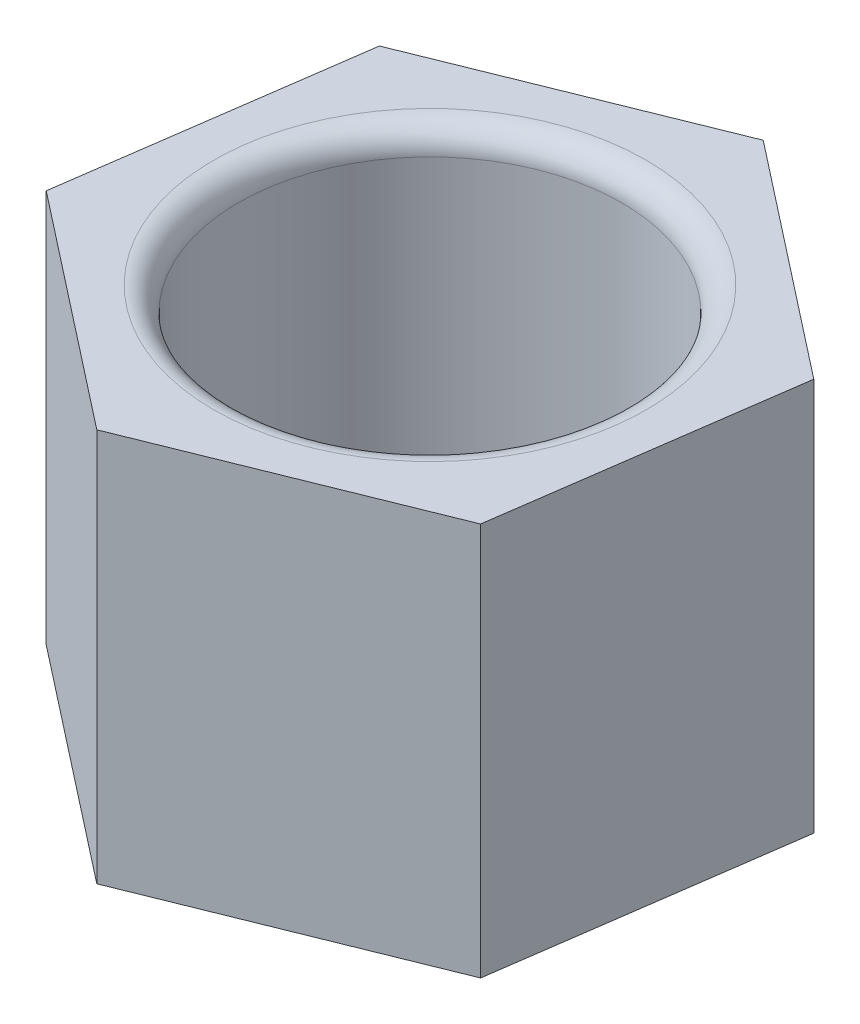
ISO-10303-21;
HEADER;
FILE_DESCRIPTION(('STEP AP214'),'2;1');
FILE_NAME('part.step','',(''),(''),'','','');
FILE_SCHEMA(('AUTOMOTIVE_DESIGN { 1 0 10303 214 1 1 1 1 }'));
ENDSEC;
DATA;
#1=APPLICATION_CONTEXT('core data for automotive mechanical design processes');
#2=APPLICATION_PROTOCOL_DEFINITION('international standard','automotive_design',2000,#1);
#3=PRODUCT_CONTEXT('',#1,'mechanical');
#4=PRODUCT('Part','Part','',(#3));
#5=PRODUCT_RELATED_PRODUCT_CATEGORY('part','',(#4));
#6=PRODUCT_DEFINITION_FORMATION('','',#4);
#7=PRODUCT_DEFINITION_CONTEXT('part definition',#1,'design');
#8=PRODUCT_DEFINITION('design','',#6,#7);
#9=PRODUCT_DEFINITION_SHAPE('','',#8);
#10=(LENGTH_UNIT() NAMED_UNIT(*) SI_UNIT(.MILLI.,.METRE.));
#11=(NAMED_UNIT(*) PLANE_ANGLE_UNIT() SI_UNIT($,.RADIAN.));
#12=(NAMED_UNIT(*) SI_UNIT($,.STERADIAN.) SOLID_ANGLE_UNIT());
#13=UNCERTAINTY_MEASURE_WITH_UNIT(LENGTH_MEASURE(1.E-05),#10,'distance_accuracy_value','');
#14=(GEOMETRIC_REPRESENTATION_CONTEXT(3) GLOBAL_UNCERTAINTY_ASSIGNED_CONTEXT((#13)) GLOBAL_UNIT_ASSIGNED_CONTEXT((#10,
#11,#12)) REPRESENTATION_CONTEXT('',''));
#15=CARTESIAN_POINT('',(0.,0.,0.));
#16=DIRECTION('',(0.,0.,1.));
#17=DIRECTION('',(1.,0.,0.));
#18=AXIS2_PLACEMENT_3D('',#15,#16,#17);
#19=CARTESIAN_POINT('',(-0.419312288901027,4.,2.97055166667348));
#20=DIRECTION('',(-0.374046913009816,0.,-0.927409783681317));
#21=DIRECTION('',(-0.927409783681317,0.,0.374046913009816));
#22=AXIS2_PLACEMENT_3D('',#19,#20,#21);
#23=PLANE('',#22);
#24=DIRECTION('',(0.927409783681317,0.,-0.374046913009816));
#25=VECTOR('',#24,1.);
#26=CARTESIAN_POINT('',(-0.419312288901027,0.,2.97055166667348));
#27=LINE('',#26,#25);
#28=CARTESIAN_POINT('',(-0.419312288901027,0.,2.97055166667348));
#29=VERTEX_POINT('',#28);
#30=CARTESIAN_POINT('',(2.36291706214292,0.,1.84841092764403));
#31=VERTEX_POINT('',#30);
#32=EDGE_CURVE('E136',#29,#31,#27,.T.);
#33=ORIENTED_EDGE('',*,*,#32,.T.);
#34=DIRECTION('',(0.,-1.,0.));
#35=VECTOR('',#34,1.);
#36=CARTESIAN_POINT('',(2.36291706214292,4.,1.84841092764403));
#37=LINE('',#36,#35);
#38=CARTESIAN_POINT('',(2.36291706214292,4.,1.84841092764403));
#39=VERTEX_POINT('',#38);
#40=EDGE_CURVE('E164',#39,#31,#37,.T.);
#41=ORIENTED_EDGE('',*,*,#40,.F.);
#42=DIRECTION('',(0.927409783681317,0.,-0.374046913009816));
#43=VECTOR('',#42,1.);
#44=CARTESIAN_POINT('',(-0.419312288901027,4.,2.97055166667348));
#45=LINE('',#44,#43);
#46=CARTESIAN_POINT('',(-0.419312288901027,4.,2.97055166667348));
#47=VERTEX_POINT('',#46);
#48=EDGE_CURVE('E153',#47,#39,#45,.T.);
#49=ORIENTED_EDGE('',*,*,#48,.F.);
#50=DIRECTION('',(0.,-1.,0.));
#51=VECTOR('',#50,1.);
#52=CARTESIAN_POINT('',(-0.419312288901027,4.,2.97055166667348));
#53=LINE('',#52,#51);
#54=EDGE_CURVE('E132',#47,#29,#53,.T.);
#55=ORIENTED_EDGE('',*,*,#54,.T.);
#56=EDGE_LOOP('',(#33,#41,#49,#55));
#57=FACE_BOUND('',#56,.T.);
#58=ADVANCED_FACE('F45',(#57),#23,.F.);
#59=CARTESIAN_POINT('',(2.36291706214292,4.,1.84841092764403));
#60=DIRECTION('',(-0.990183888891159,0.,-0.13977076296701));
#61=DIRECTION('',(-0.13977076296701,0.,0.99018388889116));
#62=AXIS2_PLACEMENT_3D('',#59,#60,#61);
#63=PLANE('',#62);
#64=DIRECTION('',(0.13977076296701,0.,-0.990183888891159));
#65=VECTOR('',#64,1.);
#66=CARTESIAN_POINT('',(2.36291706214292,0.,1.84841092764403));
#67=LINE('',#66,#65);
#68=CARTESIAN_POINT('',(2.78222935104395,0.,-1.12214073902945));
#69=VERTEX_POINT('',#68);
#70=EDGE_CURVE('E140',#31,#69,#67,.T.);
#71=ORIENTED_EDGE('',*,*,#70,.T.);
#72=DIRECTION('',(0.,-1.,0.));
#73=VECTOR('',#72,1.);
#74=CARTESIAN_POINT('',(2.78222935104395,4.,-1.12214073902945));
#75=LINE('',#74,#73);
#76=CARTESIAN_POINT('',(2.78222935104395,4.,-1.12214073902945));
#77=VERTEX_POINT('',#76);
#78=EDGE_CURVE('E160',#77,#69,#75,.T.);
#79=ORIENTED_EDGE('',*,*,#78,.F.);
#80=DIRECTION('',(0.13977076296701,0.,-0.990183888891159));
#81=VECTOR('',#80,1.);
#82=CARTESIAN_POINT('',(2.36291706214292,4.,1.84841092764403));
#83=LINE('',#82,#81);
#84=EDGE_CURVE('E101',#39,#77,#83,.T.);
#85=ORIENTED_EDGE('',*,*,#84,.F.);
#86=ORIENTED_EDGE('',*,*,#40,.T.);
#87=EDGE_LOOP('',(#71,#79,#85,#86));
#88=FACE_BOUND('',#87,.T.);
#89=ADVANCED_FACE('F184',(#88),#63,.F.);
#90=CARTESIAN_POINT('',(2.78222935104395,4.,-1.12214073902945));
#91=DIRECTION('',(-0.616136975881343,0.,0.787639020714308));
#92=DIRECTION('',(0.787639020714307,0.,0.616136975881343));
#93=AXIS2_PLACEMENT_3D('',#90,#91,#92);
#94=PLANE('',#93);
#95=DIRECTION('',(-0.787639020714307,0.,-0.616136975881343));
#96=VECTOR('',#95,1.);
#97=CARTESIAN_POINT('',(2.78222935104395,0.,-1.12214073902945));
#98=LINE('',#97,#96);
#99=CARTESIAN_POINT('',(0.419312288901028,0.,-2.97055166667348));
#100=VERTEX_POINT('',#99);
#101=EDGE_CURVE('E144',#69,#100,#98,.T.);
#102=ORIENTED_EDGE('',*,*,#101,.T.);
#103=DIRECTION('',(0.,-1.,0.));
#104=VECTOR('',#103,1.);
#105=CARTESIAN_POINT('',(0.419312288901028,4.,-2.97055166667348));
#106=LINE('',#105,#104);
#107=CARTESIAN_POINT('',(0.419312288901028,4.,-2.97055166667348));
#108=VERTEX_POINT('',#107);
#109=EDGE_CURVE('E125',#108,#100,#106,.T.);
#110=ORIENTED_EDGE('',*,*,#109,.F.);
#111=DIRECTION('',(-0.787639020714307,0.,-0.616136975881343));
#112=VECTOR('',#111,1.);
#113=CARTESIAN_POINT('',(2.78222935104395,4.,-1.12214073902945));
#114=LINE('',#113,#112);
#115=EDGE_CURVE('E114',#77,#108,#114,.T.);
#116=ORIENTED_EDGE('',*,*,#115,.F.);
#117=ORIENTED_EDGE('',*,*,#78,.T.);
#118=EDGE_LOOP('',(#102,#110,#116,#117));
#119=FACE_BOUND('',#118,.T.);
#120=ADVANCED_FACE('F189',(#119),#94,.F.);
#121=CARTESIAN_POINT('',(0.419312288901028,4.,-2.97055166667348));
#122=DIRECTION('',(0.374046913009816,0.,0.927409783681317));
#123=DIRECTION('',(0.927409783681317,0.,-0.374046913009816));
#124=AXIS2_PLACEMENT_3D('',#121,#122,#123);
#125=PLANE('',#124);
#126=DIRECTION('',(-0.927409783681317,0.,0.374046913009816));
#127=VECTOR('',#126,1.);
#128=CARTESIAN_POINT('',(0.419312288901028,0.,-2.97055166667348));
#129=LINE('',#128,#127);
#130=CARTESIAN_POINT('',(-2.36291706214292,0.,-1.84841092764403));
#131=VERTEX_POINT('',#130);
#132=EDGE_CURVE('E123',#100,#131,#129,.T.);
#133=ORIENTED_EDGE('',*,*,#132,.T.);
#134=DIRECTION('',(0.,-1.,0.));
#135=VECTOR('',#134,1.);
#136=CARTESIAN_POINT('',(-2.36291706214292,4.,-1.84841092764403));
#137=LINE('',#136,#135);
#138=CARTESIAN_POINT('',(-2.36291706214292,4.,-1.84841092764403));
#139=VERTEX_POINT('',#138);
#140=EDGE_CURVE('E120',#139,#131,#137,.T.);
#141=ORIENTED_EDGE('',*,*,#140,.F.);
#142=DIRECTION('',(-0.927409783681317,0.,0.374046913009816));
#143=VECTOR('',#142,1.);
#144=CARTESIAN_POINT('',(0.419312288901028,4.,-2.97055166667348));
#145=LINE('',#144,#143);
#146=EDGE_CURVE('E108',#108,#139,#145,.T.);
#147=ORIENTED_EDGE('',*,*,#146,.F.);
#148=ORIENTED_EDGE('',*,*,#109,.T.);
#149=EDGE_LOOP('',(#133,#141,#147,#148));
#150=FACE_BOUND('',#149,.T.);
#151=ADVANCED_FACE('F121',(#150),#125,.F.);
#152=CARTESIAN_POINT('',(-2.36291706214292,4.,-1.84841092764403));
#153=DIRECTION('',(0.990183888891159,0.,0.13977076296701));
#154=DIRECTION('',(0.13977076296701,0.,-0.99018388889116));
#155=AXIS2_PLACEMENT_3D('',#152,#153,#154);
#156=PLANE('',#155);
#157=DIRECTION('',(-0.13977076296701,0.,0.990183888891159));
#158=VECTOR('',#157,1.);
#159=CARTESIAN_POINT('',(-2.36291706214292,0.,-1.84841092764403));
#160=LINE('',#159,#158);
#161=CARTESIAN_POINT('',(-2.78222935104395,0.,1.12214073902945));
#162=VERTEX_POINT('',#161);
#163=EDGE_CURVE('E86',#131,#162,#160,.T.);
#164=ORIENTED_EDGE('',*,*,#163,.T.);
#165=DIRECTION('',(0.,-1.,0.));
#166=VECTOR('',#165,1.);
#167=CARTESIAN_POINT('',(-2.78222935104395,4.,1.12214073902945));
#168=LINE('',#167,#166);
#169=CARTESIAN_POINT('',(-2.78222935104395,4.,1.12214073902945));
#170=VERTEX_POINT('',#169);
#171=EDGE_CURVE('E126',#170,#162,#168,.T.);
#172=ORIENTED_EDGE('',*,*,#171,.F.);
#173=DIRECTION('',(-0.13977076296701,0.,0.990183888891159));
#174=VECTOR('',#173,1.);
#175=CARTESIAN_POINT('',(-2.36291706214292,4.,-1.84841092764403));
#176=LINE('',#175,#174);
#177=EDGE_CURVE('E112',#139,#170,#176,.T.);
#178=ORIENTED_EDGE('',*,*,#177,.F.);
#179=ORIENTED_EDGE('',*,*,#140,.T.);
#180=EDGE_LOOP('',(#164,#172,#178,#179));
#181=FACE_BOUND('',#180,.T.);
#182=ADVANCED_FACE('F128',(#181),#156,.F.);
#183=CARTESIAN_POINT('',(-2.78222935104395,4.,1.12214073902945));
#184=DIRECTION('',(0.616136975881343,0.,-0.787639020714308));
#185=DIRECTION('',(-0.787639020714308,0.,-0.616136975881343));
#186=AXIS2_PLACEMENT_3D('',#183,#184,#185);
#187=PLANE('',#186);
#188=DIRECTION('',(0.787639020714308,0.,0.616136975881343));
#189=VECTOR('',#188,1.);
#190=CARTESIAN_POINT('',(-2.78222935104395,0.,1.12214073902945));
#191=LINE('',#190,#189);
#192=EDGE_CURVE('E92',#162,#29,#191,.T.);
#193=ORIENTED_EDGE('',*,*,#192,.T.);
#194=ORIENTED_EDGE('',*,*,#54,.F.);
#195=DIRECTION('',(0.787639020714308,0.,0.616136975881343));
#196=VECTOR('',#195,1.);
#197=CARTESIAN_POINT('',(-2.78222935104395,4.,1.12214073902945));
#198=LINE('',#197,#196);
#199=EDGE_CURVE('E63',#170,#47,#198,.T.);
#200=ORIENTED_EDGE('',*,*,#199,.F.);
#201=ORIENTED_EDGE('',*,*,#171,.T.);
#202=EDGE_LOOP('',(#193,#194,#200,#201));
#203=FACE_BOUND('',#202,.T.);
#204=ADVANCED_FACE('F199',(#203),#187,.F.);
#205=CARTESIAN_POINT('',(0.,4.,0.));
#206=DIRECTION('',(0.,1.,0.));
#207=DIRECTION('',(0.,0.,1.));
#208=AXIS2_PLACEMENT_3D('',#205,#206,#207);
#209=PLANE('',#208);
#210=CARTESIAN_POINT('',(0.,4.,0.));
#211=DIRECTION('',(0.,1.,0.));
#212=DIRECTION('',(0.,0.,1.));
#213=AXIS2_PLACEMENT_3D('',#210,#211,#212);
#214=CIRCLE('',#213,2.2);
#215=CARTESIAN_POINT('',(0.,4.,2.2));
#216=VERTEX_POINT('',#215);
#217=EDGE_CURVE('E11',#216,#216,#214,.F.);
#218=ORIENTED_EDGE('',*,*,#217,.T.);
#219=EDGE_LOOP('',(#218));
#220=FACE_BOUND('',#219,.T.);
#221=ORIENTED_EDGE('',*,*,#48,.T.);
#222=ORIENTED_EDGE('',*,*,#84,.T.);
#223=ORIENTED_EDGE('',*,*,#115,.T.);
#224=ORIENTED_EDGE('',*,*,#146,.T.);
#225=ORIENTED_EDGE('',*,*,#177,.T.);
#226=ORIENTED_EDGE('',*,*,#199,.T.);
#227=EDGE_LOOP('',(#221,#222,#223,#224,#225,#226));
#228=FACE_BOUND('',#227,.T.);
#229=ADVANCED_FACE('F110',(#220,#228),#209,.T.);
#230=CARTESIAN_POINT('',(0.,0.,0.));
#231=DIRECTION('',(0.,1.,0.));
#232=DIRECTION('',(0.,0.,1.));
#233=AXIS2_PLACEMENT_3D('',#230,#231,#232);
#234=PLANE('',#233);
#235=ORIENTED_EDGE('',*,*,#32,.F.);
#236=ORIENTED_EDGE('',*,*,#192,.F.);
#237=ORIENTED_EDGE('',*,*,#163,.F.);
#238=ORIENTED_EDGE('',*,*,#132,.F.);
#239=ORIENTED_EDGE('',*,*,#101,.F.);
#240=ORIENTED_EDGE('',*,*,#70,.F.);
#241=EDGE_LOOP('',(#235,#236,#237,#238,#239,#240));
#242=FACE_BOUND('',#241,.T.);
#243=ADVANCED_FACE('F202',(#242),#234,.F.);
#244=CARTESIAN_POINT('',(0.,1.,0.));
#245=DIRECTION('',(0.,1.,0.));
#246=DIRECTION('',(0.,0.,1.));
#247=AXIS2_PLACEMENT_3D('',#244,#245,#246);
#248=CYLINDRICAL_SURFACE('',#247,1.95);
#249=CARTESIAN_POINT('',(0.,3.75,0.));
#250=DIRECTION('',(0.,1.,0.));
#251=DIRECTION('',(0.,0.,1.));
#252=AXIS2_PLACEMENT_3D('',#249,#250,#251);
#253=CIRCLE('',#252,1.95);
#254=CARTESIAN_POINT('',(0.,3.75,1.95));
#255=VERTEX_POINT('',#254);
#256=EDGE_CURVE('E55',#255,#255,#253,.T.);
#257=ORIENTED_EDGE('',*,*,#256,.T.);
#258=EDGE_LOOP('',(#257));
#259=FACE_BOUND('',#258,.T.);
#260=CARTESIAN_POINT('',(0.,1.,0.));
#261=DIRECTION('',(0.,1.,0.));
#262=DIRECTION('',(0.,0.,1.));
#263=AXIS2_PLACEMENT_3D('',#260,#261,#262);
#264=CIRCLE('',#263,1.95);
#265=CARTESIAN_POINT('',(0.,1.,1.95));
#266=VERTEX_POINT('',#265);
#267=EDGE_CURVE('E141',#266,#266,#264,.T.);
#268=ORIENTED_EDGE('',*,*,#267,.F.);
#269=EDGE_LOOP('',(#268));
#270=FACE_BOUND('',#269,.T.);
#271=ADVANCED_FACE('F170',(#259,#270),#248,.F.);
#272=CARTESIAN_POINT('',(0.,1.,0.));
#273=DIRECTION('',(0.,1.,0.));
#274=DIRECTION('',(0.,0.,1.));
#275=AXIS2_PLACEMENT_3D('',#272,#273,#274);
#276=PLANE('',#275);
#277=ORIENTED_EDGE('',*,*,#267,.T.);
#278=EDGE_LOOP('',(#277));
#279=FACE_BOUND('',#278,.T.);
#280=ADVANCED_FACE('F174',(#279),#276,.T.);
#281=CARTESIAN_POINT('',(0.,3.75,0.));
#282=DIRECTION('',(0.,1.,0.));
#283=DIRECTION('',(0.,0.,1.));
#284=AXIS2_PLACEMENT_3D('',#281,#282,#283);
#285=TOROIDAL_SURFACE('',#284,2.2,0.25);
#286=ORIENTED_EDGE('',*,*,#217,.F.);
#287=EDGE_LOOP('',(#286));
#288=FACE_BOUND('',#287,.T.);
#289=ORIENTED_EDGE('',*,*,#256,.F.);
#290=EDGE_LOOP('',(#289));
#291=FACE_BOUND('',#290,.T.);
#292=ADVANCED_FACE('F47',(#288,#291),#285,.T.);
#293=CLOSED_SHELL('',(#58,#89,#120,#151,#182,#204,#229,#243,#271,#280,#292));
#294=MANIFOLD_SOLID_BREP('B2',#293);
#295=ADVANCED_BREP_SHAPE_REPRESENTATION('',(#18,#294),#14);
#296=SHAPE_DEFINITION_REPRESENTATION(#9,#295);
ENDSEC;
END-ISO-10303-21;
